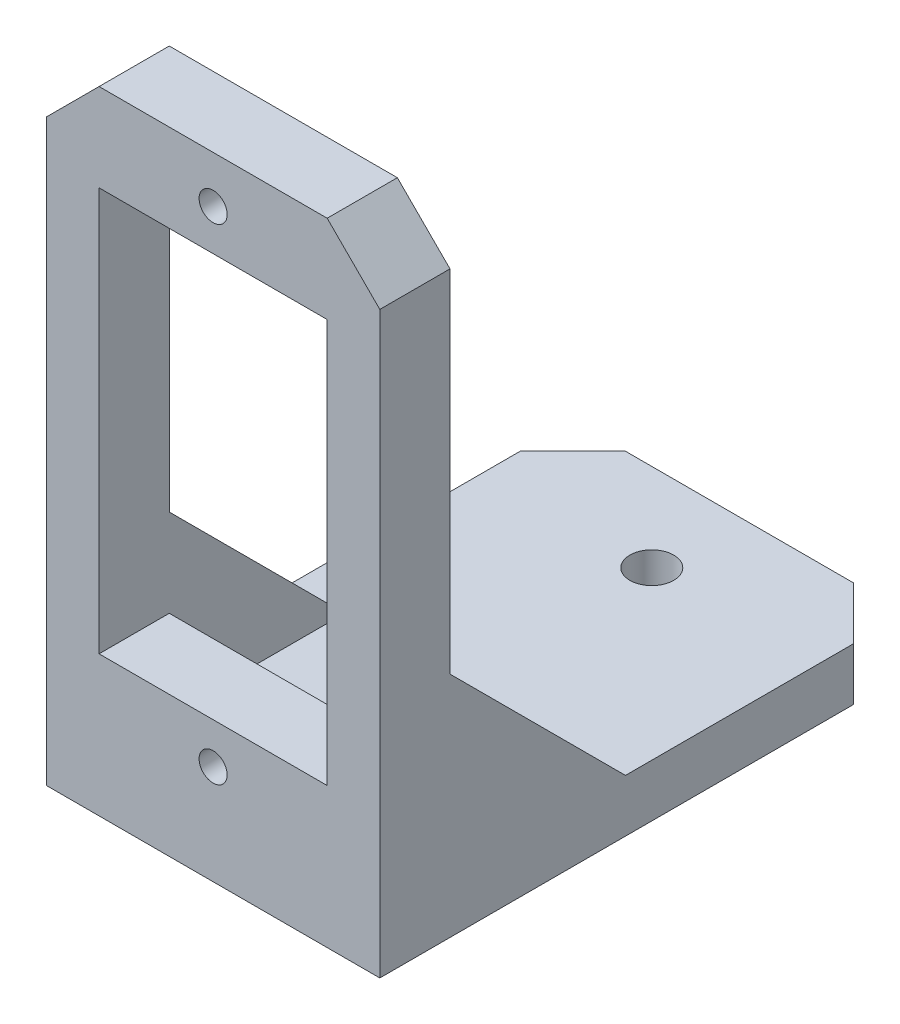
ISO-10303-21;
HEADER;
FILE_DESCRIPTION(('STEP AP214'),'2;1');
FILE_NAME('part.step','',(''),(''),'','','');
FILE_SCHEMA(('AUTOMOTIVE_DESIGN { 1 0 10303 214 1 1 1 1 }'));
ENDSEC;
DATA;
#1=APPLICATION_CONTEXT('core data for automotive mechanical design processes');
#2=APPLICATION_PROTOCOL_DEFINITION('international standard','automotive_design',2000,#1);
#3=PRODUCT_CONTEXT('',#1,'mechanical');
#4=PRODUCT('Part','Part','',(#3));
#5=PRODUCT_RELATED_PRODUCT_CATEGORY('part','',(#4));
#6=PRODUCT_DEFINITION_FORMATION('','',#4);
#7=PRODUCT_DEFINITION_CONTEXT('part definition',#1,'design');
#8=PRODUCT_DEFINITION('design','',#6,#7);
#9=PRODUCT_DEFINITION_SHAPE('','',#8);
#10=(LENGTH_UNIT() NAMED_UNIT(*) SI_UNIT(.MILLI.,.METRE.));
#11=(NAMED_UNIT(*) PLANE_ANGLE_UNIT() SI_UNIT($,.RADIAN.));
#12=(NAMED_UNIT(*) SI_UNIT($,.STERADIAN.) SOLID_ANGLE_UNIT());
#13=UNCERTAINTY_MEASURE_WITH_UNIT(LENGTH_MEASURE(1.E-05),#10,'distance_accuracy_value','');
#14=(GEOMETRIC_REPRESENTATION_CONTEXT(3) GLOBAL_UNCERTAINTY_ASSIGNED_CONTEXT((#13)) GLOBAL_UNIT_ASSIGNED_CONTEXT((#10,
#11,#12)) REPRESENTATION_CONTEXT('',''));
#15=CARTESIAN_POINT('',(0.,0.,0.));
#16=DIRECTION('',(0.,0.,1.));
#17=DIRECTION('',(1.,0.,0.));
#18=AXIS2_PLACEMENT_3D('',#15,#16,#17);
#19=CARTESIAN_POINT('',(0.,0.,0.));
#20=DIRECTION('',(0.,0.,-1.));
#21=DIRECTION('',(-1.,0.,0.));
#22=AXIS2_PLACEMENT_3D('',#19,#20,#21);
#23=PLANE('',#22);
#24=CARTESIAN_POINT('',(0.,-13.83,0.));
#25=DIRECTION('',(0.,0.,-1.));
#26=DIRECTION('',(-1.,0.,0.));
#27=AXIS2_PLACEMENT_3D('',#24,#25,#26);
#28=CIRCLE('',#27,0.8);
#29=CARTESIAN_POINT('',(-0.799999999999995,-13.83,0.));
#30=VERTEX_POINT('',#29);
#31=EDGE_CURVE('E251',#30,#30,#28,.T.);
#32=ORIENTED_EDGE('',*,*,#31,.F.);
#33=EDGE_LOOP('',(#32));
#34=FACE_BOUND('',#33,.T.);
#35=DIRECTION('',(1.,0.,0.));
#36=VECTOR('',#35,1.);
#37=CARTESIAN_POINT('',(-9.5,-16.5,0.));
#38=LINE('',#37,#36);
#39=CARTESIAN_POINT('',(-6.5,-16.5,0.));
#40=VERTEX_POINT('',#39);
#41=CARTESIAN_POINT('',(6.5,-16.5,0.));
#42=VERTEX_POINT('',#41);
#43=EDGE_CURVE('E185',#40,#42,#38,.T.);
#44=ORIENTED_EDGE('',*,*,#43,.F.);
#45=DIRECTION('',(0.,1.,0.));
#46=VECTOR('',#45,1.);
#47=CARTESIAN_POINT('',(-6.5,-16.5,0.));
#48=LINE('',#47,#46);
#49=CARTESIAN_POINT('',(-6.5,-11.5,0.));
#50=VERTEX_POINT('',#49);
#51=EDGE_CURVE('E362',#40,#50,#48,.T.);
#52=ORIENTED_EDGE('',*,*,#51,.T.);
#53=DIRECTION('',(-1.,0.,0.));
#54=VECTOR('',#53,1.);
#55=CARTESIAN_POINT('',(0.,-11.5,0.));
#56=LINE('',#55,#54);
#57=CARTESIAN_POINT('',(6.5,-11.5,0.));
#58=VERTEX_POINT('',#57);
#59=EDGE_CURVE('E261',#58,#50,#56,.T.);
#60=ORIENTED_EDGE('',*,*,#59,.F.);
#61=DIRECTION('',(0.,-1.,0.));
#62=VECTOR('',#61,1.);
#63=CARTESIAN_POINT('',(6.5,-6.5,0.));
#64=LINE('',#63,#62);
#65=EDGE_CURVE('E171',#58,#42,#64,.T.);
#66=ORIENTED_EDGE('',*,*,#65,.T.);
#67=EDGE_LOOP('',(#44,#52,#60,#66));
#68=FACE_BOUND('',#67,.T.);
#69=ADVANCED_FACE('F33',(#34,#68),#23,.T.);
#70=CARTESIAN_POINT('',(9.5,-16.5,4.));
#71=DIRECTION('',(-1.,0.,0.));
#72=DIRECTION('',(0.,0.,1.));
#73=AXIS2_PLACEMENT_3D('',#70,#71,#72);
#74=PLANE('',#73);
#75=DIRECTION('',(0.,0.,1.));
#76=VECTOR('',#75,1.);
#77=CARTESIAN_POINT('',(9.5,-19.5,-26.));
#78=LINE('',#77,#76);
#79=CARTESIAN_POINT('',(9.5,-19.5,-23.));
#80=VERTEX_POINT('',#79);
#81=CARTESIAN_POINT('',(9.5,-19.5,4.));
#82=VERTEX_POINT('',#81);
#83=EDGE_CURVE('E209',#80,#82,#78,.T.);
#84=ORIENTED_EDGE('',*,*,#83,.F.);
#85=DIRECTION('',(0.,1.,0.));
#86=VECTOR('',#85,1.);
#87=CARTESIAN_POINT('',(9.5,-16.5,-23.));
#88=LINE('',#87,#86);
#89=CARTESIAN_POINT('',(9.5,-16.5,-23.));
#90=VERTEX_POINT('',#89);
#91=EDGE_CURVE('E11',#80,#90,#88,.T.);
#92=ORIENTED_EDGE('',*,*,#91,.T.);
#93=DIRECTION('',(0.,0.,1.));
#94=VECTOR('',#93,1.);
#95=CARTESIAN_POINT('',(9.5,-16.5,-26.));
#96=LINE('',#95,#94);
#97=CARTESIAN_POINT('',(9.5,-16.5,-10.));
#98=VERTEX_POINT('',#97);
#99=EDGE_CURVE('E207',#90,#98,#96,.T.);
#100=ORIENTED_EDGE('',*,*,#99,.T.);
#101=DIRECTION('',(0.,0.707106781186547,0.707106781186548));
#102=VECTOR('',#101,1.);
#103=CARTESIAN_POINT('',(9.5,-16.5,-10.));
#104=LINE('',#103,#102);
#105=CARTESIAN_POINT('',(9.5,-6.5,0.));
#106=VERTEX_POINT('',#105);
#107=EDGE_CURVE('E166',#98,#106,#104,.T.);
#108=ORIENTED_EDGE('',*,*,#107,.T.);
#109=DIRECTION('',(0.,1.,0.));
#110=VECTOR('',#109,1.);
#111=CARTESIAN_POINT('',(9.5,-16.5,0.));
#112=LINE('',#111,#110);
#113=CARTESIAN_POINT('',(9.5,13.5,0.));
#114=VERTEX_POINT('',#113);
#115=EDGE_CURVE('E248',#106,#114,#112,.T.);
#116=ORIENTED_EDGE('',*,*,#115,.T.);
#117=DIRECTION('',(0.,0.,1.));
#118=VECTOR('',#117,1.);
#119=CARTESIAN_POINT('',(9.5,13.5,4.));
#120=LINE('',#119,#118);
#121=CARTESIAN_POINT('',(9.5,13.5,4.));
#122=VERTEX_POINT('',#121);
#123=EDGE_CURVE('E286',#114,#122,#120,.T.);
#124=ORIENTED_EDGE('',*,*,#123,.T.);
#125=DIRECTION('',(0.,1.,0.));
#126=VECTOR('',#125,1.);
#127=CARTESIAN_POINT('',(9.5,-16.5,4.));
#128=LINE('',#127,#126);
#129=EDGE_CURVE('E238',#82,#122,#128,.T.);
#130=ORIENTED_EDGE('',*,*,#129,.F.);
#131=EDGE_LOOP('',(#84,#92,#100,#108,#116,#124,#130));
#132=FACE_BOUND('',#131,.T.);
#133=ADVANCED_FACE('F318',(#132),#74,.F.);
#134=CARTESIAN_POINT('',(-9.5,16.5,4.));
#135=DIRECTION('',(0.,-1.,0.));
#136=DIRECTION('',(0.,0.,-1.));
#137=AXIS2_PLACEMENT_3D('',#134,#135,#136);
#138=PLANE('',#137);
#139=DIRECTION('',(-1.,0.,0.));
#140=VECTOR('',#139,1.);
#141=CARTESIAN_POINT('',(-9.5,16.5,0.));
#142=LINE('',#141,#140);
#143=CARTESIAN_POINT('',(6.5,16.5,0.));
#144=VERTEX_POINT('',#143);
#145=CARTESIAN_POINT('',(-6.49999999999999,16.5,0.));
#146=VERTEX_POINT('',#145);
#147=EDGE_CURVE('E250',#144,#146,#142,.T.);
#148=ORIENTED_EDGE('',*,*,#147,.T.);
#149=DIRECTION('',(0.,0.,1.));
#150=VECTOR('',#149,1.);
#151=CARTESIAN_POINT('',(-6.49999999999999,16.5,4.));
#152=LINE('',#151,#150);
#153=CARTESIAN_POINT('',(-6.49999999999999,16.5,4.));
#154=VERTEX_POINT('',#153);
#155=EDGE_CURVE('E280',#146,#154,#152,.T.);
#156=ORIENTED_EDGE('',*,*,#155,.T.);
#157=DIRECTION('',(-1.,0.,0.));
#158=VECTOR('',#157,1.);
#159=CARTESIAN_POINT('',(-9.5,16.5,4.));
#160=LINE('',#159,#158);
#161=CARTESIAN_POINT('',(6.5,16.5,4.));
#162=VERTEX_POINT('',#161);
#163=EDGE_CURVE('E241',#162,#154,#160,.T.);
#164=ORIENTED_EDGE('',*,*,#163,.F.);
#165=DIRECTION('',(0.,0.,-1.));
#166=VECTOR('',#165,1.);
#167=CARTESIAN_POINT('',(6.5,16.5,4.));
#168=LINE('',#167,#166);
#169=EDGE_CURVE('E277',#162,#144,#168,.T.);
#170=ORIENTED_EDGE('',*,*,#169,.T.);
#171=EDGE_LOOP('',(#148,#156,#164,#170));
#172=FACE_BOUND('',#171,.T.);
#173=ADVANCED_FACE('F335',(#172),#138,.F.);
#174=CARTESIAN_POINT('',(-9.5,-16.5,4.));
#175=DIRECTION('',(1.,0.,0.));
#176=DIRECTION('',(0.,0.,-1.));
#177=AXIS2_PLACEMENT_3D('',#174,#175,#176);
#178=PLANE('',#177);
#179=DIRECTION('',(0.,0.,1.));
#180=VECTOR('',#179,1.);
#181=CARTESIAN_POINT('',(-9.5,-16.5,-26.));
#182=LINE('',#181,#180);
#183=CARTESIAN_POINT('',(-9.5,-16.5,-23.));
#184=VERTEX_POINT('',#183);
#185=CARTESIAN_POINT('',(-9.5,-16.5,-10.));
#186=VERTEX_POINT('',#185);
#187=EDGE_CURVE('E204',#184,#186,#182,.T.);
#188=ORIENTED_EDGE('',*,*,#187,.F.);
#189=DIRECTION('',(0.,-1.,0.));
#190=VECTOR('',#189,1.);
#191=CARTESIAN_POINT('',(-9.5,-16.5,-23.));
#192=LINE('',#191,#190);
#193=CARTESIAN_POINT('',(-9.5,-19.5,-23.));
#194=VERTEX_POINT('',#193);
#195=EDGE_CURVE('E288',#184,#194,#192,.T.);
#196=ORIENTED_EDGE('',*,*,#195,.T.);
#197=DIRECTION('',(0.,0.,1.));
#198=VECTOR('',#197,1.);
#199=CARTESIAN_POINT('',(-9.5,-19.5,-26.));
#200=LINE('',#199,#198);
#201=CARTESIAN_POINT('',(-9.5,-19.5,4.));
#202=VERTEX_POINT('',#201);
#203=EDGE_CURVE('E201',#194,#202,#200,.T.);
#204=ORIENTED_EDGE('',*,*,#203,.T.);
#205=DIRECTION('',(0.,-1.,0.));
#206=VECTOR('',#205,1.);
#207=CARTESIAN_POINT('',(-9.5,-16.5,4.));
#208=LINE('',#207,#206);
#209=CARTESIAN_POINT('',(-9.5,13.5,4.));
#210=VERTEX_POINT('',#209);
#211=EDGE_CURVE('E244',#210,#202,#208,.T.);
#212=ORIENTED_EDGE('',*,*,#211,.F.);
#213=DIRECTION('',(0.,0.,-1.));
#214=VECTOR('',#213,1.);
#215=CARTESIAN_POINT('',(-9.5,13.5,4.));
#216=LINE('',#215,#214);
#217=CARTESIAN_POINT('',(-9.5,13.5,0.));
#218=VERTEX_POINT('',#217);
#219=EDGE_CURVE('E265',#210,#218,#216,.T.);
#220=ORIENTED_EDGE('',*,*,#219,.T.);
#221=DIRECTION('',(0.,-1.,0.));
#222=VECTOR('',#221,1.);
#223=CARTESIAN_POINT('',(-9.5,-16.5,0.));
#224=LINE('',#223,#222);
#225=CARTESIAN_POINT('',(-9.5,-6.5,0.));
#226=VERTEX_POINT('',#225);
#227=EDGE_CURVE('E254',#218,#226,#224,.T.);
#228=ORIENTED_EDGE('',*,*,#227,.T.);
#229=DIRECTION('',(0.,-0.707106781186547,-0.707106781186548));
#230=VECTOR('',#229,1.);
#231=CARTESIAN_POINT('',(-9.5,-6.5,0.));
#232=LINE('',#231,#230);
#233=EDGE_CURVE('E308',#226,#186,#232,.T.);
#234=ORIENTED_EDGE('',*,*,#233,.T.);
#235=EDGE_LOOP('',(#188,#196,#204,#212,#220,#228,#234));
#236=FACE_BOUND('',#235,.T.);
#237=ADVANCED_FACE('F305',(#236),#178,.F.);
#238=CARTESIAN_POINT('',(0.,0.,4.));
#239=DIRECTION('',(0.,0.,-1.));
#240=DIRECTION('',(-1.,0.,0.));
#241=AXIS2_PLACEMENT_3D('',#238,#239,#240);
#242=PLANE('',#241);
#243=CARTESIAN_POINT('',(0.,-13.83,4.));
#244=DIRECTION('',(0.,0.,1.));
#245=DIRECTION('',(-1.,0.,0.));
#246=AXIS2_PLACEMENT_3D('',#243,#244,#245);
#247=CIRCLE('',#246,0.8);
#248=CARTESIAN_POINT('',(-0.799999999999995,-13.83,4.));
#249=VERTEX_POINT('',#248);
#250=EDGE_CURVE('E206',#249,#249,#247,.T.);
#251=ORIENTED_EDGE('',*,*,#250,.F.);
#252=EDGE_LOOP('',(#251));
#253=FACE_BOUND('',#252,.T.);
#254=CARTESIAN_POINT('',(0.,13.83,4.));
#255=DIRECTION('',(0.,0.,1.));
#256=DIRECTION('',(1.,0.,0.));
#257=AXIS2_PLACEMENT_3D('',#254,#255,#256);
#258=CIRCLE('',#257,0.8);
#259=CARTESIAN_POINT('',(0.8,13.83,4.));
#260=VERTEX_POINT('',#259);
#261=EDGE_CURVE('E212',#260,#260,#258,.T.);
#262=ORIENTED_EDGE('',*,*,#261,.F.);
#263=EDGE_LOOP('',(#262));
#264=FACE_BOUND('',#263,.T.);
#265=DIRECTION('',(-1.,0.,0.));
#266=VECTOR('',#265,1.);
#267=CARTESIAN_POINT('',(-6.5,11.5,4.));
#268=LINE('',#267,#266);
#269=CARTESIAN_POINT('',(6.5,11.5,4.));
#270=VERTEX_POINT('',#269);
#271=CARTESIAN_POINT('',(-6.5,11.5,4.));
#272=VERTEX_POINT('',#271);
#273=EDGE_CURVE('E219',#270,#272,#268,.T.);
#274=ORIENTED_EDGE('',*,*,#273,.F.);
#275=DIRECTION('',(0.,1.,0.));
#276=VECTOR('',#275,1.);
#277=CARTESIAN_POINT('',(6.5,-11.5,4.));
#278=LINE('',#277,#276);
#279=CARTESIAN_POINT('',(6.5,-11.5,4.));
#280=VERTEX_POINT('',#279);
#281=EDGE_CURVE('E215',#280,#270,#278,.T.);
#282=ORIENTED_EDGE('',*,*,#281,.F.);
#283=DIRECTION('',(1.,0.,0.));
#284=VECTOR('',#283,1.);
#285=CARTESIAN_POINT('',(-6.5,-11.5,4.));
#286=LINE('',#285,#284);
#287=CARTESIAN_POINT('',(-6.5,-11.5,4.));
#288=VERTEX_POINT('',#287);
#289=EDGE_CURVE('E225',#288,#280,#286,.T.);
#290=ORIENTED_EDGE('',*,*,#289,.F.);
#291=DIRECTION('',(0.,-1.,0.));
#292=VECTOR('',#291,1.);
#293=CARTESIAN_POINT('',(-6.5,-11.5,4.));
#294=LINE('',#293,#292);
#295=EDGE_CURVE('E222',#272,#288,#294,.T.);
#296=ORIENTED_EDGE('',*,*,#295,.F.);
#297=EDGE_LOOP('',(#274,#282,#290,#296));
#298=FACE_BOUND('',#297,.T.);
#299=ORIENTED_EDGE('',*,*,#163,.T.);
#300=DIRECTION('',(0.707106781186549,0.707106781186546,0.));
#301=VECTOR('',#300,1.);
#302=CARTESIAN_POINT('',(-9.5,13.5,4.));
#303=LINE('',#302,#301);
#304=EDGE_CURVE('E284',#154,#210,#303,.F.);
#305=ORIENTED_EDGE('',*,*,#304,.T.);
#306=ORIENTED_EDGE('',*,*,#211,.T.);
#307=DIRECTION('',(1.,0.,0.));
#308=VECTOR('',#307,1.);
#309=CARTESIAN_POINT('',(-9.5,-19.5,4.));
#310=LINE('',#309,#308);
#311=EDGE_CURVE('E194',#202,#82,#310,.T.);
#312=ORIENTED_EDGE('',*,*,#311,.T.);
#313=ORIENTED_EDGE('',*,*,#129,.T.);
#314=DIRECTION('',(0.707106781186546,-0.707106781186549,0.));
#315=VECTOR('',#314,1.);
#316=CARTESIAN_POINT('',(6.5,16.5,4.));
#317=LINE('',#316,#315);
#318=EDGE_CURVE('E282',#122,#162,#317,.F.);
#319=ORIENTED_EDGE('',*,*,#318,.T.);
#320=EDGE_LOOP('',(#299,#305,#306,#312,#313,#319));
#321=FACE_BOUND('',#320,.T.);
#322=ADVANCED_FACE('F322',(#253,#264,#298,#321),#242,.F.);
#323=DIRECTION('',(-1.,0.,0.));
#324=VECTOR('',#323,1.);
#325=CARTESIAN_POINT('',(-6.5,-6.5,0.));
#326=LINE('',#325,#324);
#327=CARTESIAN_POINT('',(-6.5,-6.5,0.));
#328=VERTEX_POINT('',#327);
#329=EDGE_CURVE('E190',#328,#226,#326,.T.);
#330=ORIENTED_EDGE('',*,*,#329,.T.);
#331=ORIENTED_EDGE('',*,*,#227,.F.);
#332=DIRECTION('',(-0.707106781186549,-0.707106781186546,0.));
#333=VECTOR('',#332,1.);
#334=CARTESIAN_POINT('',(-11.5,11.5,0.));
#335=LINE('',#334,#333);
#336=EDGE_CURVE('E275',#218,#146,#335,.F.);
#337=ORIENTED_EDGE('',*,*,#336,.T.);
#338=ORIENTED_EDGE('',*,*,#147,.F.);
#339=DIRECTION('',(-0.707106781186546,0.707106781186549,0.));
#340=VECTOR('',#339,1.);
#341=CARTESIAN_POINT('',(11.5,11.5,0.));
#342=LINE('',#341,#340);
#343=EDGE_CURVE('E272',#144,#114,#342,.F.);
#344=ORIENTED_EDGE('',*,*,#343,.T.);
#345=ORIENTED_EDGE('',*,*,#115,.F.);
#346=DIRECTION('',(1.,0.,0.));
#347=VECTOR('',#346,1.);
#348=CARTESIAN_POINT('',(6.5,-6.5,0.));
#349=LINE('',#348,#347);
#350=CARTESIAN_POINT('',(6.5,-6.5,0.));
#351=VERTEX_POINT('',#350);
#352=EDGE_CURVE('E170',#351,#106,#349,.T.);
#353=ORIENTED_EDGE('',*,*,#352,.F.);
#354=DIRECTION('',(0.,-1.,0.));
#355=VECTOR('',#354,1.);
#356=CARTESIAN_POINT('',(6.5,0.,0.));
#357=LINE('',#356,#355);
#358=CARTESIAN_POINT('',(6.5,11.5,0.));
#359=VERTEX_POINT('',#358);
#360=EDGE_CURVE('E181',#359,#351,#357,.T.);
#361=ORIENTED_EDGE('',*,*,#360,.F.);
#362=DIRECTION('',(1.,0.,0.));
#363=VECTOR('',#362,1.);
#364=CARTESIAN_POINT('',(0.,11.5,0.));
#365=LINE('',#364,#363);
#366=CARTESIAN_POINT('',(-6.5,11.5,0.));
#367=VERTEX_POINT('',#366);
#368=EDGE_CURVE('E247',#367,#359,#365,.T.);
#369=ORIENTED_EDGE('',*,*,#368,.F.);
#370=DIRECTION('',(0.,1.,0.));
#371=VECTOR('',#370,1.);
#372=CARTESIAN_POINT('',(-6.5,0.,0.));
#373=LINE('',#372,#371);
#374=EDGE_CURVE('E259',#328,#367,#373,.T.);
#375=ORIENTED_EDGE('',*,*,#374,.F.);
#376=EDGE_LOOP('',(#330,#331,#337,#338,#344,#345,#353,#361,#369,#375));
#377=FACE_BOUND('',#376,.T.);
#378=CARTESIAN_POINT('',(0.,13.83,0.));
#379=DIRECTION('',(0.,0.,-1.));
#380=DIRECTION('',(-1.,0.,0.));
#381=AXIS2_PLACEMENT_3D('',#378,#379,#380);
#382=CIRCLE('',#381,0.8);
#383=CARTESIAN_POINT('',(-0.8,13.83,0.));
#384=VERTEX_POINT('',#383);
#385=EDGE_CURVE('E231',#384,#384,#382,.T.);
#386=ORIENTED_EDGE('',*,*,#385,.F.);
#387=EDGE_LOOP('',(#386));
#388=FACE_BOUND('',#387,.T.);
#389=ADVANCED_FACE('F332',(#377,#388),#23,.T.);
#390=CARTESIAN_POINT('',(6.5,-11.5,-1.));
#391=DIRECTION('',(1.,0.,0.));
#392=DIRECTION('',(0.,0.,-1.));
#393=AXIS2_PLACEMENT_3D('',#390,#391,#392);
#394=PLANE('',#393);
#395=ORIENTED_EDGE('',*,*,#360,.T.);
#396=DIRECTION('',(0.,0.707106781186547,0.707106781186548));
#397=VECTOR('',#396,1.);
#398=CARTESIAN_POINT('',(6.5,-16.5,-10.));
#399=LINE('',#398,#397);
#400=CARTESIAN_POINT('',(6.5,-16.5,-10.));
#401=VERTEX_POINT('',#400);
#402=EDGE_CURVE('E163',#401,#351,#399,.T.);
#403=ORIENTED_EDGE('',*,*,#402,.F.);
#404=DIRECTION('',(0.,0.,-1.));
#405=VECTOR('',#404,1.);
#406=CARTESIAN_POINT('',(6.5,-16.5,0.));
#407=LINE('',#406,#405);
#408=EDGE_CURVE('E177',#42,#401,#407,.T.);
#409=ORIENTED_EDGE('',*,*,#408,.F.);
#410=ORIENTED_EDGE('',*,*,#65,.F.);
#411=DIRECTION('',(0.,0.,1.));
#412=VECTOR('',#411,1.);
#413=CARTESIAN_POINT('',(6.5,-11.5,-1.));
#414=LINE('',#413,#412);
#415=EDGE_CURVE('E229',#58,#280,#414,.T.);
#416=ORIENTED_EDGE('',*,*,#415,.T.);
#417=ORIENTED_EDGE('',*,*,#281,.T.);
#418=DIRECTION('',(0.,0.,1.));
#419=VECTOR('',#418,1.);
#420=CARTESIAN_POINT('',(6.5,11.5,-1.));
#421=LINE('',#420,#419);
#422=EDGE_CURVE('E228',#359,#270,#421,.T.);
#423=ORIENTED_EDGE('',*,*,#422,.F.);
#424=EDGE_LOOP('',(#395,#403,#409,#410,#416,#417,#423));
#425=FACE_BOUND('',#424,.T.);
#426=ADVANCED_FACE('F176',(#425),#394,.F.);
#427=CARTESIAN_POINT('',(-6.5,-11.5,-1.));
#428=DIRECTION('',(0.,-1.,0.));
#429=DIRECTION('',(0.,0.,-1.));
#430=AXIS2_PLACEMENT_3D('',#427,#428,#429);
#431=PLANE('',#430);
#432=ORIENTED_EDGE('',*,*,#59,.T.);
#433=DIRECTION('',(0.,0.,1.));
#434=VECTOR('',#433,1.);
#435=CARTESIAN_POINT('',(-6.5,-11.5,-1.));
#436=LINE('',#435,#434);
#437=EDGE_CURVE('E232',#50,#288,#436,.T.);
#438=ORIENTED_EDGE('',*,*,#437,.T.);
#439=ORIENTED_EDGE('',*,*,#289,.T.);
#440=ORIENTED_EDGE('',*,*,#415,.F.);
#441=EDGE_LOOP('',(#432,#438,#439,#440));
#442=FACE_BOUND('',#441,.T.);
#443=ADVANCED_FACE('F394',(#442),#431,.F.);
#444=CARTESIAN_POINT('',(-6.5,-11.5,-1.));
#445=DIRECTION('',(-1.,0.,0.));
#446=DIRECTION('',(0.,0.,1.));
#447=AXIS2_PLACEMENT_3D('',#444,#445,#446);
#448=PLANE('',#447);
#449=ORIENTED_EDGE('',*,*,#437,.F.);
#450=ORIENTED_EDGE('',*,*,#51,.F.);
#451=DIRECTION('',(0.,0.,1.));
#452=VECTOR('',#451,1.);
#453=CARTESIAN_POINT('',(-6.5,-16.5,0.));
#454=LINE('',#453,#452);
#455=CARTESIAN_POINT('',(-6.5,-16.5,-10.));
#456=VERTEX_POINT('',#455);
#457=EDGE_CURVE('E360',#456,#40,#454,.T.);
#458=ORIENTED_EDGE('',*,*,#457,.F.);
#459=DIRECTION('',(0.,-0.707106781186547,-0.707106781186548));
#460=VECTOR('',#459,1.);
#461=CARTESIAN_POINT('',(-6.5,-6.5,0.));
#462=LINE('',#461,#460);
#463=EDGE_CURVE('E359',#328,#456,#462,.T.);
#464=ORIENTED_EDGE('',*,*,#463,.F.);
#465=ORIENTED_EDGE('',*,*,#374,.T.);
#466=DIRECTION('',(0.,0.,1.));
#467=VECTOR('',#466,1.);
#468=CARTESIAN_POINT('',(-6.5,11.5,-1.));
#469=LINE('',#468,#467);
#470=EDGE_CURVE('E234',#367,#272,#469,.T.);
#471=ORIENTED_EDGE('',*,*,#470,.T.);
#472=ORIENTED_EDGE('',*,*,#295,.T.);
#473=EDGE_LOOP('',(#449,#450,#458,#464,#465,#471,#472));
#474=FACE_BOUND('',#473,.T.);
#475=ADVANCED_FACE('F354',(#474),#448,.F.);
#476=CARTESIAN_POINT('',(-6.5,11.5,-1.));
#477=DIRECTION('',(0.,1.,0.));
#478=DIRECTION('',(0.,0.,1.));
#479=AXIS2_PLACEMENT_3D('',#476,#477,#478);
#480=PLANE('',#479);
#481=ORIENTED_EDGE('',*,*,#368,.T.);
#482=ORIENTED_EDGE('',*,*,#422,.T.);
#483=ORIENTED_EDGE('',*,*,#273,.T.);
#484=ORIENTED_EDGE('',*,*,#470,.F.);
#485=EDGE_LOOP('',(#481,#482,#483,#484));
#486=FACE_BOUND('',#485,.T.);
#487=ADVANCED_FACE('F345',(#486),#480,.F.);
#488=CARTESIAN_POINT('',(0.,13.83,-1.));
#489=DIRECTION('',(0.,0.,1.));
#490=DIRECTION('',(1.,0.,0.));
#491=AXIS2_PLACEMENT_3D('',#488,#489,#490);
#492=CYLINDRICAL_SURFACE('',#491,0.8);
#493=ORIENTED_EDGE('',*,*,#385,.T.);
#494=EDGE_LOOP('',(#493));
#495=FACE_BOUND('',#494,.T.);
#496=ORIENTED_EDGE('',*,*,#261,.T.);
#497=EDGE_LOOP('',(#496));
#498=FACE_BOUND('',#497,.T.);
#499=ADVANCED_FACE('F405',(#495,#498),#492,.F.);
#500=CARTESIAN_POINT('',(0.,-13.83,-1.));
#501=DIRECTION('',(0.,0.,1.));
#502=DIRECTION('',(1.,0.,0.));
#503=AXIS2_PLACEMENT_3D('',#500,#501,#502);
#504=CYLINDRICAL_SURFACE('',#503,0.8);
#505=ORIENTED_EDGE('',*,*,#31,.T.);
#506=EDGE_LOOP('',(#505));
#507=FACE_BOUND('',#506,.T.);
#508=ORIENTED_EDGE('',*,*,#250,.T.);
#509=EDGE_LOOP('',(#508));
#510=FACE_BOUND('',#509,.T.);
#511=ADVANCED_FACE('F411',(#507,#510),#504,.F.);
#512=CARTESIAN_POINT('',(-9.5,13.5,4.));
#513=DIRECTION('',(0.707106781186546,-0.707106781186549,0.));
#514=DIRECTION('',(0.,0.,-1.));
#515=AXIS2_PLACEMENT_3D('',#512,#513,#514);
#516=PLANE('',#515);
#517=ORIENTED_EDGE('',*,*,#304,.F.);
#518=ORIENTED_EDGE('',*,*,#155,.F.);
#519=ORIENTED_EDGE('',*,*,#336,.F.);
#520=ORIENTED_EDGE('',*,*,#219,.F.);
#521=EDGE_LOOP('',(#517,#518,#519,#520));
#522=FACE_BOUND('',#521,.T.);
#523=ADVANCED_FACE('F328',(#522),#516,.F.);
#524=CARTESIAN_POINT('',(6.5,16.5,4.));
#525=DIRECTION('',(-0.707106781186549,-0.707106781186546,0.));
#526=DIRECTION('',(0.,0.,-1.));
#527=AXIS2_PLACEMENT_3D('',#524,#525,#526);
#528=PLANE('',#527);
#529=ORIENTED_EDGE('',*,*,#318,.F.);
#530=ORIENTED_EDGE('',*,*,#123,.F.);
#531=ORIENTED_EDGE('',*,*,#343,.F.);
#532=ORIENTED_EDGE('',*,*,#169,.F.);
#533=EDGE_LOOP('',(#529,#530,#531,#532));
#534=FACE_BOUND('',#533,.T.);
#535=ADVANCED_FACE('F339',(#534),#528,.F.);
#536=CARTESIAN_POINT('',(-9.5,-16.5,-26.));
#537=DIRECTION('',(0.,1.,0.));
#538=DIRECTION('',(0.,0.,1.));
#539=AXIS2_PLACEMENT_3D('',#536,#537,#538);
#540=PLANE('',#539);
#541=CARTESIAN_POINT('',(0.,-16.5,-5.99999999999999));
#542=DIRECTION('',(0.,1.,0.));
#543=DIRECTION('',(0.,0.,1.));
#544=AXIS2_PLACEMENT_3D('',#541,#542,#543);
#545=CIRCLE('',#544,1.25);
#546=CARTESIAN_POINT('',(0.,-16.5,-4.74999999999999));
#547=VERTEX_POINT('',#546);
#548=EDGE_CURVE('E561',#547,#547,#545,.T.);
#549=ORIENTED_EDGE('',*,*,#548,.F.);
#550=EDGE_LOOP('',(#549));
#551=FACE_BOUND('',#550,.T.);
#552=CARTESIAN_POINT('',(0.,-16.5,-21.));
#553=DIRECTION('',(0.,1.,0.));
#554=DIRECTION('',(0.,0.,1.));
#555=AXIS2_PLACEMENT_3D('',#552,#553,#554);
#556=CIRCLE('',#555,1.25);
#557=CARTESIAN_POINT('',(0.,-16.5,-19.75));
#558=VERTEX_POINT('',#557);
#559=EDGE_CURVE('E566',#558,#558,#556,.T.);
#560=ORIENTED_EDGE('',*,*,#559,.F.);
#561=EDGE_LOOP('',(#560));
#562=FACE_BOUND('',#561,.T.);
#563=DIRECTION('',(-1.,0.,0.));
#564=VECTOR('',#563,1.);
#565=CARTESIAN_POINT('',(-9.5,-16.5,-26.));
#566=LINE('',#565,#564);
#567=CARTESIAN_POINT('',(6.49999999999999,-16.5,-26.));
#568=VERTEX_POINT('',#567);
#569=CARTESIAN_POINT('',(-6.49999999999999,-16.5,-26.));
#570=VERTEX_POINT('',#569);
#571=EDGE_CURVE('E199',#568,#570,#566,.T.);
#572=ORIENTED_EDGE('',*,*,#571,.T.);
#573=DIRECTION('',(0.707106781186548,0.,-0.707106781186547));
#574=VECTOR('',#573,1.);
#575=CARTESIAN_POINT('',(-8.,-16.5,-24.5));
#576=LINE('',#575,#574);
#577=EDGE_CURVE('E41',#570,#184,#576,.F.);
#578=ORIENTED_EDGE('',*,*,#577,.T.);
#579=ORIENTED_EDGE('',*,*,#187,.T.);
#580=DIRECTION('',(-1.,0.,0.));
#581=VECTOR('',#580,1.);
#582=CARTESIAN_POINT('',(-6.5,-16.5,-10.));
#583=LINE('',#582,#581);
#584=EDGE_CURVE('E187',#456,#186,#583,.T.);
#585=ORIENTED_EDGE('',*,*,#584,.F.);
#586=ORIENTED_EDGE('',*,*,#457,.T.);
#587=ORIENTED_EDGE('',*,*,#43,.T.);
#588=ORIENTED_EDGE('',*,*,#408,.T.);
#589=DIRECTION('',(1.,0.,0.));
#590=VECTOR('',#589,1.);
#591=CARTESIAN_POINT('',(6.5,-16.5,-10.));
#592=LINE('',#591,#590);
#593=EDGE_CURVE('E160',#401,#98,#592,.T.);
#594=ORIENTED_EDGE('',*,*,#593,.T.);
#595=ORIENTED_EDGE('',*,*,#99,.F.);
#596=DIRECTION('',(0.707106781186548,0.,0.707106781186547));
#597=VECTOR('',#596,1.);
#598=CARTESIAN_POINT('',(-1.50000000000002,-16.5,-34.));
#599=LINE('',#598,#597);
#600=EDGE_CURVE('E48',#90,#568,#599,.F.);
#601=ORIENTED_EDGE('',*,*,#600,.T.);
#602=EDGE_LOOP('',(#572,#578,#579,#585,#586,#587,#588,#594,#595,#601));
#603=FACE_BOUND('',#602,.T.);
#604=ADVANCED_FACE('F183',(#551,#562,#603),#540,.T.);
#605=CARTESIAN_POINT('',(-9.5,-19.5,-26.));
#606=DIRECTION('',(0.,-1.,0.));
#607=DIRECTION('',(0.,0.,-1.));
#608=AXIS2_PLACEMENT_3D('',#605,#606,#607);
#609=PLANE('',#608);
#610=CARTESIAN_POINT('',(0.,-19.5,-5.99999999999999));
#611=DIRECTION('',(0.,1.,0.));
#612=DIRECTION('',(0.,0.,1.));
#613=AXIS2_PLACEMENT_3D('',#610,#611,#612);
#614=CIRCLE('',#613,1.25);
#615=CARTESIAN_POINT('',(0.,-19.5,-4.74999999999999));
#616=VERTEX_POINT('',#615);
#617=EDGE_CURVE('E368',#616,#616,#614,.T.);
#618=ORIENTED_EDGE('',*,*,#617,.T.);
#619=EDGE_LOOP('',(#618));
#620=FACE_BOUND('',#619,.T.);
#621=CARTESIAN_POINT('',(0.,-19.5,-21.));
#622=DIRECTION('',(0.,1.,0.));
#623=DIRECTION('',(0.,0.,1.));
#624=AXIS2_PLACEMENT_3D('',#621,#622,#623);
#625=CIRCLE('',#624,1.25);
#626=CARTESIAN_POINT('',(0.,-19.5,-19.75));
#627=VERTEX_POINT('',#626);
#628=EDGE_CURVE('E562',#627,#627,#625,.T.);
#629=ORIENTED_EDGE('',*,*,#628,.T.);
#630=EDGE_LOOP('',(#629));
#631=FACE_BOUND('',#630,.T.);
#632=ORIENTED_EDGE('',*,*,#203,.F.);
#633=DIRECTION('',(-0.707106781186548,0.,0.707106781186547));
#634=VECTOR('',#633,1.);
#635=CARTESIAN_POINT('',(-8.,-19.5,-24.5));
#636=LINE('',#635,#634);
#637=CARTESIAN_POINT('',(-6.49999999999999,-19.5,-26.));
#638=VERTEX_POINT('',#637);
#639=EDGE_CURVE('E293',#194,#638,#636,.F.);
#640=ORIENTED_EDGE('',*,*,#639,.T.);
#641=DIRECTION('',(1.,0.,0.));
#642=VECTOR('',#641,1.);
#643=CARTESIAN_POINT('',(-9.5,-19.5,-26.));
#644=LINE('',#643,#642);
#645=CARTESIAN_POINT('',(6.49999999999999,-19.5,-26.));
#646=VERTEX_POINT('',#645);
#647=EDGE_CURVE('E196',#638,#646,#644,.T.);
#648=ORIENTED_EDGE('',*,*,#647,.T.);
#649=DIRECTION('',(-0.707106781186548,0.,-0.707106781186547));
#650=VECTOR('',#649,1.);
#651=CARTESIAN_POINT('',(-1.50000000000002,-19.5,-34.));
#652=LINE('',#651,#650);
#653=EDGE_CURVE('E291',#646,#80,#652,.F.);
#654=ORIENTED_EDGE('',*,*,#653,.T.);
#655=ORIENTED_EDGE('',*,*,#83,.T.);
#656=ORIENTED_EDGE('',*,*,#311,.F.);
#657=EDGE_LOOP('',(#632,#640,#648,#654,#655,#656));
#658=FACE_BOUND('',#657,.T.);
#659=ADVANCED_FACE('F311',(#620,#631,#658),#609,.T.);
#660=CARTESIAN_POINT('',(0.,0.,-26.));
#661=DIRECTION('',(0.,0.,1.));
#662=DIRECTION('',(1.,0.,0.));
#663=AXIS2_PLACEMENT_3D('',#660,#661,#662);
#664=PLANE('',#663);
#665=ORIENTED_EDGE('',*,*,#647,.F.);
#666=DIRECTION('',(0.,1.,0.));
#667=VECTOR('',#666,1.);
#668=CARTESIAN_POINT('',(-6.49999999999999,0.,-26.));
#669=LINE('',#668,#667);
#670=EDGE_CURVE('E55',#638,#570,#669,.T.);
#671=ORIENTED_EDGE('',*,*,#670,.T.);
#672=ORIENTED_EDGE('',*,*,#571,.F.);
#673=DIRECTION('',(0.,-1.,0.));
#674=VECTOR('',#673,1.);
#675=CARTESIAN_POINT('',(6.49999999999999,0.,-26.));
#676=LINE('',#675,#674);
#677=EDGE_CURVE('E295',#568,#646,#676,.T.);
#678=ORIENTED_EDGE('',*,*,#677,.T.);
#679=EDGE_LOOP('',(#665,#671,#672,#678));
#680=FACE_BOUND('',#679,.T.);
#681=ADVANCED_FACE('F314',(#680),#664,.F.);
#682=CARTESIAN_POINT('',(6.5,-16.5,-10.));
#683=DIRECTION('',(0.,0.707106781186548,-0.707106781186547));
#684=DIRECTION('',(0.,0.707106781186547,0.707106781186548));
#685=AXIS2_PLACEMENT_3D('',#682,#683,#684);
#686=PLANE('',#685);
#687=ORIENTED_EDGE('',*,*,#107,.F.);
#688=ORIENTED_EDGE('',*,*,#593,.F.);
#689=ORIENTED_EDGE('',*,*,#402,.T.);
#690=ORIENTED_EDGE('',*,*,#352,.T.);
#691=EDGE_LOOP('',(#687,#688,#689,#690));
#692=FACE_BOUND('',#691,.T.);
#693=ADVANCED_FACE('F162',(#692),#686,.T.);
#694=CARTESIAN_POINT('',(-6.5,-6.5,0.));
#695=DIRECTION('',(0.,0.707106781186548,-0.707106781186547));
#696=DIRECTION('',(0.,0.707106781186547,0.707106781186548));
#697=AXIS2_PLACEMENT_3D('',#694,#695,#696);
#698=PLANE('',#697);
#699=ORIENTED_EDGE('',*,*,#233,.F.);
#700=ORIENTED_EDGE('',*,*,#329,.F.);
#701=ORIENTED_EDGE('',*,*,#463,.T.);
#702=ORIENTED_EDGE('',*,*,#584,.T.);
#703=EDGE_LOOP('',(#699,#700,#701,#702));
#704=FACE_BOUND('',#703,.T.);
#705=ADVANCED_FACE('F369',(#704),#698,.T.);
#706=CARTESIAN_POINT('',(-9.5,-16.5,-23.));
#707=DIRECTION('',(0.707106781186547,0.,0.707106781186548));
#708=DIRECTION('',(0.,-1.,0.));
#709=AXIS2_PLACEMENT_3D('',#706,#707,#708);
#710=PLANE('',#709);
#711=ORIENTED_EDGE('',*,*,#577,.F.);
#712=ORIENTED_EDGE('',*,*,#670,.F.);
#713=ORIENTED_EDGE('',*,*,#639,.F.);
#714=ORIENTED_EDGE('',*,*,#195,.F.);
#715=EDGE_LOOP('',(#711,#712,#713,#714));
#716=FACE_BOUND('',#715,.T.);
#717=ADVANCED_FACE('F309',(#716),#710,.F.);
#718=CARTESIAN_POINT('',(9.5,-16.5,-23.));
#719=DIRECTION('',(-0.707106781186547,0.,0.707106781186548));
#720=DIRECTION('',(0.,1.,0.));
#721=AXIS2_PLACEMENT_3D('',#718,#719,#720);
#722=PLANE('',#721);
#723=ORIENTED_EDGE('',*,*,#653,.F.);
#724=ORIENTED_EDGE('',*,*,#677,.F.);
#725=ORIENTED_EDGE('',*,*,#600,.F.);
#726=ORIENTED_EDGE('',*,*,#91,.F.);
#727=EDGE_LOOP('',(#723,#724,#725,#726));
#728=FACE_BOUND('',#727,.T.);
#729=ADVANCED_FACE('F35',(#728),#722,.F.);
#730=CARTESIAN_POINT('',(0.,-19.5,-21.));
#731=DIRECTION('',(0.,1.,0.));
#732=DIRECTION('',(0.,0.,1.));
#733=AXIS2_PLACEMENT_3D('',#730,#731,#732);
#734=CYLINDRICAL_SURFACE('',#733,1.25);
#735=ORIENTED_EDGE('',*,*,#628,.F.);
#736=EDGE_LOOP('',(#735));
#737=FACE_BOUND('',#736,.T.);
#738=ORIENTED_EDGE('',*,*,#559,.T.);
#739=EDGE_LOOP('',(#738));
#740=FACE_BOUND('',#739,.T.);
#741=ADVANCED_FACE('F538',(#737,#740),#734,.F.);
#742=CARTESIAN_POINT('',(0.,-19.5,-5.99999999999999));
#743=DIRECTION('',(0.,1.,0.));
#744=DIRECTION('',(0.,0.,1.));
#745=AXIS2_PLACEMENT_3D('',#742,#743,#744);
#746=CYLINDRICAL_SURFACE('',#745,1.25);
#747=ORIENTED_EDGE('',*,*,#617,.F.);
#748=EDGE_LOOP('',(#747));
#749=FACE_BOUND('',#748,.T.);
#750=ORIENTED_EDGE('',*,*,#548,.T.);
#751=EDGE_LOOP('',(#750));
#752=FACE_BOUND('',#751,.T.);
#753=ADVANCED_FACE('F543',(#749,#752),#746,.F.);
#754=CLOSED_SHELL('',(#69,#133,#173,#237,#322,#389,#426,#443,#475,#487,#499,#511,#523,#535,#604,
#659,#681,#693,#705,#717,#729,#741,#753));
#755=MANIFOLD_SOLID_BREP('B2',#754);
#756=ADVANCED_BREP_SHAPE_REPRESENTATION('',(#18,#755),#14);
#757=SHAPE_DEFINITION_REPRESENTATION(#9,#756);
ENDSEC;
END-ISO-10303-21;
